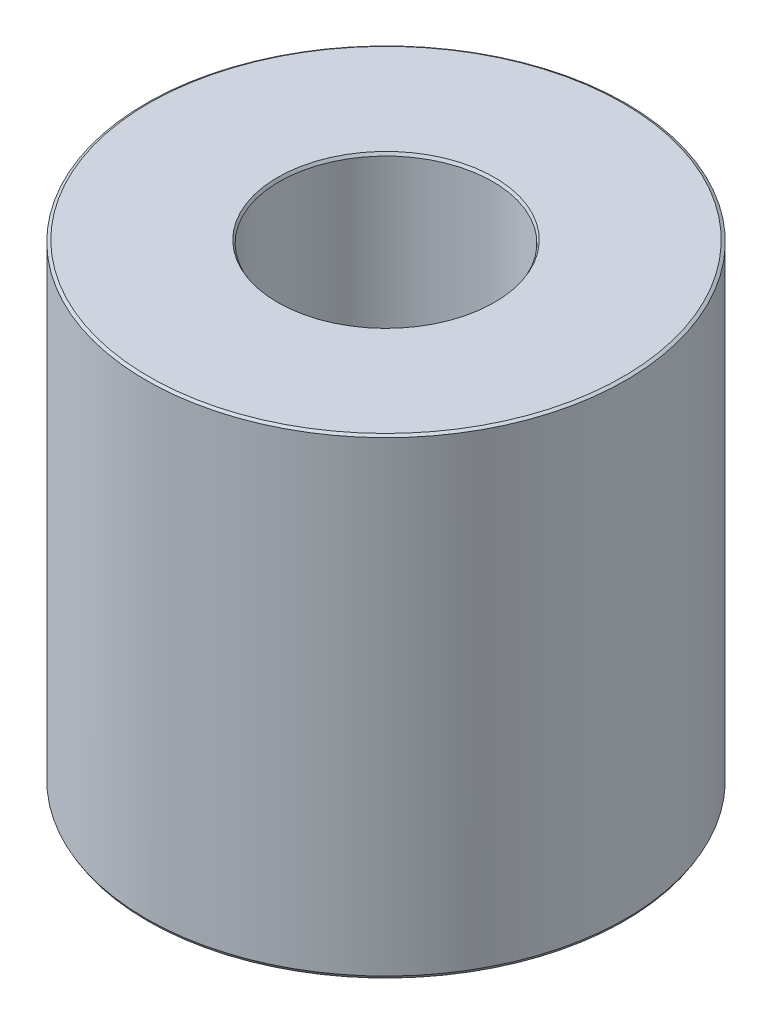
ISO-10303-21;
HEADER;
FILE_DESCRIPTION(('STEP AP214'),'2;1');
FILE_NAME('part.step','',(''),(''),'','','');
FILE_SCHEMA(('AUTOMOTIVE_DESIGN { 1 0 10303 214 1 1 1 1 }'));
ENDSEC;
DATA;
#1=APPLICATION_CONTEXT('core data for automotive mechanical design processes');
#2=APPLICATION_PROTOCOL_DEFINITION('international standard','automotive_design',2000,#1);
#3=PRODUCT_CONTEXT('',#1,'mechanical');
#4=PRODUCT('Part','Part','',(#3));
#5=PRODUCT_RELATED_PRODUCT_CATEGORY('part','',(#4));
#6=PRODUCT_DEFINITION_FORMATION('','',#4);
#7=PRODUCT_DEFINITION_CONTEXT('part definition',#1,'design');
#8=PRODUCT_DEFINITION('design','',#6,#7);
#9=PRODUCT_DEFINITION_SHAPE('','',#8);
#10=(LENGTH_UNIT() NAMED_UNIT(*) SI_UNIT(.MILLI.,.METRE.));
#11=(NAMED_UNIT(*) PLANE_ANGLE_UNIT() SI_UNIT($,.RADIAN.));
#12=(NAMED_UNIT(*) SI_UNIT($,.STERADIAN.) SOLID_ANGLE_UNIT());
#13=UNCERTAINTY_MEASURE_WITH_UNIT(LENGTH_MEASURE(1.E-05),#10,'distance_accuracy_value','');
#14=(GEOMETRIC_REPRESENTATION_CONTEXT(3) GLOBAL_UNCERTAINTY_ASSIGNED_CONTEXT((#13)) GLOBAL_UNIT_ASSIGNED_CONTEXT((#10,
#11,#12)) REPRESENTATION_CONTEXT('',''));
#15=CARTESIAN_POINT('',(0.,0.,0.));
#16=DIRECTION('',(0.,0.,1.));
#17=DIRECTION('',(1.,0.,0.));
#18=AXIS2_PLACEMENT_3D('',#15,#16,#17);
#19=CARTESIAN_POINT('',(0.,78.5003908281606,0.));
#20=DIRECTION('',(0.,-1.,0.));
#21=DIRECTION('',(0.,0.,-1.));
#22=AXIS2_PLACEMENT_3D('',#19,#20,#21);
#23=CYLINDRICAL_SURFACE('',#22,40.);
#24=CARTESIAN_POINT('',(0.,0.475728291631561,0.));
#25=DIRECTION('',(0.,1.,0.));
#26=DIRECTION('',(0.,0.,1.));
#27=AXIS2_PLACEMENT_3D('',#24,#25,#26);
#28=CIRCLE('',#27,40.);
#29=CARTESIAN_POINT('',(0.,0.475728291631561,40.));
#30=VERTEX_POINT('',#29);
#31=EDGE_CURVE('E10',#30,#30,#28,.T.);
#32=ORIENTED_EDGE('',*,*,#31,.T.);
#33=EDGE_LOOP('',(#32));
#34=FACE_BOUND('',#33,.T.);
#35=CARTESIAN_POINT('',(0.,78.225728970926,0.));
#36=DIRECTION('',(0.,1.,0.));
#37=DIRECTION('',(0.,0.,1.));
#38=AXIS2_PLACEMENT_3D('',#35,#36,#37);
#39=CIRCLE('',#38,40.);
#40=CARTESIAN_POINT('',(0.,78.225728970926,-40.));
#41=VERTEX_POINT('',#40);
#42=EDGE_CURVE('E50',#41,#41,#39,.F.);
#43=ORIENTED_EDGE('',*,*,#42,.T.);
#44=EDGE_LOOP('',(#43));
#45=FACE_BOUND('',#44,.T.);
#46=ADVANCED_FACE('F39',(#34,#45),#23,.T.);
#47=CARTESIAN_POINT('',(0.,78.5003908281606,0.));
#48=DIRECTION('',(0.,1.,0.));
#49=DIRECTION('',(0.,0.,1.));
#50=AXIS2_PLACEMENT_3D('',#47,#48,#49);
#51=PLANE('',#50);
#52=CARTESIAN_POINT('',(0.,78.5003908281606,0.));
#53=DIRECTION('',(0.,1.,0.));
#54=DIRECTION('',(0.,0.,1.));
#55=AXIS2_PLACEMENT_3D('',#52,#53,#54);
#56=CIRCLE('',#55,18.0730213265673);
#57=CARTESIAN_POINT('',(0.,78.5003908281606,18.0730213265673));
#58=VERTEX_POINT('',#57);
#59=EDGE_CURVE('E58',#58,#58,#56,.F.);
#60=ORIENTED_EDGE('',*,*,#59,.T.);
#61=EDGE_LOOP('',(#60));
#62=FACE_BOUND('',#61,.T.);
#63=CARTESIAN_POINT('',(0.,78.5003908281606,0.));
#64=DIRECTION('',(0.,1.,0.));
#65=DIRECTION('',(0.,0.,1.));
#66=AXIS2_PLACEMENT_3D('',#63,#64,#65);
#67=CIRCLE('',#66,39.5242717083684);
#68=CARTESIAN_POINT('',(0.,78.5003908281606,-39.5242717083684));
#69=VERTEX_POINT('',#68);
#70=EDGE_CURVE('E61',#69,#69,#67,.T.);
#71=ORIENTED_EDGE('',*,*,#70,.T.);
#72=EDGE_LOOP('',(#71));
#73=FACE_BOUND('',#72,.T.);
#74=ADVANCED_FACE('F88',(#62,#73),#51,.T.);
#75=CARTESIAN_POINT('',(0.,0.,0.));
#76=DIRECTION('',(0.,1.,0.));
#77=DIRECTION('',(0.,0.,1.));
#78=AXIS2_PLACEMENT_3D('',#75,#76,#77);
#79=PLANE('',#78);
#80=CARTESIAN_POINT('',(0.,0.,0.));
#81=DIRECTION('',(0.,1.,0.));
#82=DIRECTION('',(0.,0.,1.));
#83=AXIS2_PLACEMENT_3D('',#80,#81,#82);
#84=CIRCLE('',#83,18.2740877609643);
#85=CARTESIAN_POINT('',(0.,0.,18.2740877609643));
#86=VERTEX_POINT('',#85);
#87=EDGE_CURVE('E51',#86,#86,#84,.T.);
#88=ORIENTED_EDGE('',*,*,#87,.T.);
#89=EDGE_LOOP('',(#88));
#90=FACE_BOUND('',#89,.T.);
#91=CARTESIAN_POINT('',(0.,0.,0.));
#92=DIRECTION('',(0.,1.,0.));
#93=DIRECTION('',(0.,0.,1.));
#94=AXIS2_PLACEMENT_3D('',#91,#92,#93);
#95=CIRCLE('',#94,39.7253381427654);
#96=CARTESIAN_POINT('',(0.,0.,39.7253381427654));
#97=VERTEX_POINT('',#96);
#98=EDGE_CURVE('E54',#97,#97,#95,.F.);
#99=ORIENTED_EDGE('',*,*,#98,.T.);
#100=EDGE_LOOP('',(#99));
#101=FACE_BOUND('',#100,.T.);
#102=ADVANCED_FACE('F83',(#90,#101),#79,.F.);
#103=CARTESIAN_POINT('',(0.,78.5003908281606,0.));
#104=DIRECTION('',(0.,-1.,0.));
#105=DIRECTION('',(0.,0.,-1.));
#106=AXIS2_PLACEMENT_3D('',#103,#104,#105);
#107=CYLINDRICAL_SURFACE('',#106,17.7983594693327);
#108=CARTESIAN_POINT('',(0.,78.0246625365291,0.));
#109=DIRECTION('',(0.,1.,0.));
#110=DIRECTION('',(0.,0.,1.));
#111=AXIS2_PLACEMENT_3D('',#108,#109,#110);
#112=CIRCLE('',#111,17.7983594693327);
#113=CARTESIAN_POINT('',(0.,78.0246625365291,17.7983594693327));
#114=VERTEX_POINT('',#113);
#115=EDGE_CURVE('E67',#114,#114,#112,.T.);
#116=ORIENTED_EDGE('',*,*,#115,.T.);
#117=EDGE_LOOP('',(#116));
#118=FACE_BOUND('',#117,.T.);
#119=CARTESIAN_POINT('',(0.,0.274661857234584,0.));
#120=DIRECTION('',(0.,1.,0.));
#121=DIRECTION('',(0.,0.,1.));
#122=AXIS2_PLACEMENT_3D('',#119,#120,#121);
#123=CIRCLE('',#122,17.7983594693327);
#124=CARTESIAN_POINT('',(0.,0.274661857234584,17.7983594693327));
#125=VERTEX_POINT('',#124);
#126=EDGE_CURVE('E69',#125,#125,#123,.F.);
#127=ORIENTED_EDGE('',*,*,#126,.T.);
#128=EDGE_LOOP('',(#127));
#129=FACE_BOUND('',#128,.T.);
#130=ADVANCED_FACE('F71',(#118,#129),#107,.F.);
#131=CARTESIAN_POINT('',(0.,78.0246625365291,0.));
#132=DIRECTION('',(0.,1.,0.));
#133=DIRECTION('',(0.,0.,1.));
#134=AXIS2_PLACEMENT_3D('',#131,#132,#133);
#135=CONICAL_SURFACE('',#134,17.7983594693327,0.523598775598281);
#136=ORIENTED_EDGE('',*,*,#59,.F.);
#137=EDGE_LOOP('',(#136));
#138=FACE_BOUND('',#137,.T.);
#139=ORIENTED_EDGE('',*,*,#115,.F.);
#140=EDGE_LOOP('',(#139));
#141=FACE_BOUND('',#140,.T.);
#142=ADVANCED_FACE('F77',(#138,#141),#135,.F.);
#143=CARTESIAN_POINT('',(0.,0.,0.));
#144=DIRECTION('',(0.,-1.,0.));
#145=DIRECTION('',(0.,0.,-1.));
#146=AXIS2_PLACEMENT_3D('',#143,#144,#145);
#147=CONICAL_SURFACE('',#146,18.2740877609643,1.0471975511966);
#148=ORIENTED_EDGE('',*,*,#126,.F.);
#149=EDGE_LOOP('',(#148));
#150=FACE_BOUND('',#149,.T.);
#151=ORIENTED_EDGE('',*,*,#87,.F.);
#152=EDGE_LOOP('',(#151));
#153=FACE_BOUND('',#152,.T.);
#154=ADVANCED_FACE('F73',(#150,#153),#147,.F.);
#155=CARTESIAN_POINT('',(0.,0.475728291631561,0.));
#156=DIRECTION('',(0.,1.,0.));
#157=DIRECTION('',(0.,0.,1.));
#158=AXIS2_PLACEMENT_3D('',#155,#156,#157);
#159=CONICAL_SURFACE('',#158,40.,0.523598775598303);
#160=ORIENTED_EDGE('',*,*,#98,.F.);
#161=EDGE_LOOP('',(#160));
#162=FACE_BOUND('',#161,.T.);
#163=ORIENTED_EDGE('',*,*,#31,.F.);
#164=EDGE_LOOP('',(#163));
#165=FACE_BOUND('',#164,.T.);
#166=ADVANCED_FACE('F76',(#162,#165),#159,.T.);
#167=CARTESIAN_POINT('',(0.,78.5003908281606,0.));
#168=DIRECTION('',(0.,-1.,0.));
#169=DIRECTION('',(0.,0.,-1.));
#170=AXIS2_PLACEMENT_3D('',#167,#168,#169);
#171=CONICAL_SURFACE('',#170,39.5242717083684,1.04719755119659);
#172=CARTESIAN_POINT('',(0.,78.225728970926,-40.));
#173=CARTESIAN_POINT('',(0.,78.2285900319389,-39.9950444969622));
#174=CARTESIAN_POINT('',(0.,78.2314510929517,-39.9900889939244));
#175=CARTESIAN_POINT('',(0.,78.2371732149774,-39.9801779878487));
#176=CARTESIAN_POINT('',(0.,78.2400342759903,-39.9752224848109));
#177=CARTESIAN_POINT('',(0.,78.245756398016,-39.9653114787352));
#178=CARTESIAN_POINT('',(0.,78.2486174590289,-39.9603559756974));
#179=CARTESIAN_POINT('',(0.,78.2543395810546,-39.9504449696217));
#180=CARTESIAN_POINT('',(0.,78.2572006420675,-39.9454894665839));
#181=CARTESIAN_POINT('',(0.,78.2629227640932,-39.9355784605082));
#182=CARTESIAN_POINT('',(0.,78.265783825106,-39.9306229574704));
#183=CARTESIAN_POINT('',(0.,78.2715059471318,-39.9207119513948));
#184=CARTESIAN_POINT('',(0.,78.2743670081446,-39.9157564483569));
#185=CARTESIAN_POINT('',(0.,78.2800891301704,-39.9058454422813));
#186=CARTESIAN_POINT('',(0.,78.2829501911832,-39.9008899392434));
#187=CARTESIAN_POINT('',(0.,78.2886723132089,-39.8909789331678));
#188=CARTESIAN_POINT('',(0.,78.2915333742218,-39.88602343013));
#189=CARTESIAN_POINT('',(0.,78.2972554962475,-39.8761124240543));
#190=CARTESIAN_POINT('',(0.,78.3001165572604,-39.8711569210165));
#191=CARTESIAN_POINT('',(0.,78.3058386792861,-39.8612459149408));
#192=CARTESIAN_POINT('',(0.,78.308699740299,-39.856290411903));
#193=CARTESIAN_POINT('',(0.,78.3144218623247,-39.8463794058273));
#194=CARTESIAN_POINT('',(0.,78.3172829233375,-39.8414239027895));
#195=CARTESIAN_POINT('',(0.,78.3230050453633,-39.8315128967138));
#196=CARTESIAN_POINT('',(0.,78.3258661063761,-39.826557393676));
#197=CARTESIAN_POINT('',(0.,78.3315882284018,-39.8166463876003));
#198=CARTESIAN_POINT('',(0.,78.3344492894147,-39.8116908845625));
#199=CARTESIAN_POINT('',(0.,78.3401714114404,-39.8017798784869));
#200=CARTESIAN_POINT('',(0.,78.3430324724533,-39.796824375449));
#201=CARTESIAN_POINT('',(0.,78.348754594479,-39.7869133693734));
#202=CARTESIAN_POINT('',(0.,78.3516156554919,-39.7819578663355));
#203=CARTESIAN_POINT('',(0.,78.3573377775176,-39.7720468602599));
#204=CARTESIAN_POINT('',(0.,78.3601988385305,-39.7670913572221));
#205=CARTESIAN_POINT('',(0.,78.3659209605562,-39.7571803511464));
#206=CARTESIAN_POINT('',(0.,78.368782021569,-39.7522248481086));
#207=CARTESIAN_POINT('',(0.,78.3745041435947,-39.7423138420329));
#208=CARTESIAN_POINT('',(0.,78.3773652046076,-39.7373583389951));
#209=CARTESIAN_POINT('',(0.,78.3830873266333,-39.7274473329194));
#210=CARTESIAN_POINT('',(0.,78.3859483876462,-39.7224918298816));
#211=CARTESIAN_POINT('',(0.,78.3916705096719,-39.7125808238059));
#212=CARTESIAN_POINT('',(0.,78.3945315706847,-39.7076253207681));
#213=CARTESIAN_POINT('',(0.,78.4002536927105,-39.6977143146925));
#214=CARTESIAN_POINT('',(0.,78.4031147537233,-39.6927588116546));
#215=CARTESIAN_POINT('',(0.,78.4088368757491,-39.682847805579));
#216=CARTESIAN_POINT('',(0.,78.4116979367619,-39.6778923025411));
#217=CARTESIAN_POINT('',(0.,78.4174200587876,-39.6679812964655));
#218=CARTESIAN_POINT('',(0.,78.4202811198005,-39.6630257934277));
#219=CARTESIAN_POINT('',(0.,78.4260032418262,-39.653114787352));
#220=CARTESIAN_POINT('',(0.,78.4288643028391,-39.6481592843142));
#221=CARTESIAN_POINT('',(0.,78.4345864248648,-39.6382482782385));
#222=CARTESIAN_POINT('',(0.,78.4374474858777,-39.6332927752007));
#223=CARTESIAN_POINT('',(0.,78.4431696079034,-39.623381769125));
#224=CARTESIAN_POINT('',(0.,78.4460306689163,-39.6184262660872));
#225=CARTESIAN_POINT('',(0.,78.451752790942,-39.6085152600115));
#226=CARTESIAN_POINT('',(0.,78.4546138519548,-39.6035597569737));
#227=CARTESIAN_POINT('',(0.,78.4603359739805,-39.593648750898));
#228=CARTESIAN_POINT('',(0.,78.4631970349934,-39.5886932478602));
#229=CARTESIAN_POINT('',(0.,78.4689191570191,-39.5787822417846));
#230=CARTESIAN_POINT('',(0.,78.471780218032,-39.5738267387467));
#231=CARTESIAN_POINT('',(0.,78.4775023400577,-39.5639157326711));
#232=CARTESIAN_POINT('',(0.,78.4803634010706,-39.5589602296333));
#233=CARTESIAN_POINT('',(0.,78.4860855230963,-39.5490492235576));
#234=CARTESIAN_POINT('',(0.,78.4889465841092,-39.5440937205198));
#235=CARTESIAN_POINT('',(0.,78.4946687061349,-39.5341827144441));
#236=CARTESIAN_POINT('',(0.,78.4975297671477,-39.5292272114063));
#237=CARTESIAN_POINT('',(0.,78.5003908281606,-39.5242717083684));
#238=B_SPLINE_CURVE_WITH_KNOTS('',3,(#172,#173,#174,#175,#176,#177,#178,#179,#180,#181,#182,
#183,#184,#185,#186,#187,#188,#189,#190,#191,#192,#193,#194,#195,#196,#197,#198,#199,#200,#201,
#202,#203,#204,#205,#206,#207,#208,#209,#210,#211,#212,#213,#214,#215,#216,#217,#218,#219,#220,
#221,#222,#223,#224,#225,#226,#227,#228,#229,#230,#231,#232,#233,#234,#235,#236,#237),
.UNSPECIFIED.,.F.,.F.,(4,2,2,2,2,2,2,2,2,2,2,2,2,2,2,2,2,2,2,2,2,2,2,2,2,2,2,2,2,2,2,2,4),(0.,
0.0171663660771704,0.0343327321543278,0.0514990982314981,0.0686654643086556,0.085831830385819,
0.102998196462983,0.120164562540147,0.137330928617304,0.154497294694475,0.171663660771638,
0.188830026848795,0.205996392925966,0.223162759003123,0.240329125080287,0.257495491157451,
0.274661857234614,0.291828223311772,0.308994589388942,0.326160955466099,0.343327321543263,
0.360493687620427,0.377660053697591,0.394826419774748,0.411992785851918,0.429159151929082,
0.446325518006239,0.46349188408341,0.480658250160567,0.49782461623773,0.514990982314895,
0.532157348392058,0.549323714469223),.UNSPECIFIED.);
#239=EDGE_CURVE('BSEAM45',#41,#69,#238,.T.);
#240=ORIENTED_EDGE('',*,*,#42,.F.);
#241=ORIENTED_EDGE('',*,*,#70,.F.);
#242=ORIENTED_EDGE('',*,*,#239,.T.);
#243=ORIENTED_EDGE('',*,*,#239,.F.);
#244=EDGE_LOOP('',(#240,#242,#241,#243));
#245=FACE_BOUND('',#244,.T.);
#246=ADVANCED_FACE('F45',(#245),#171,.T.);
#247=CLOSED_SHELL('',(#46,#74,#102,#130,#142,#154,#166,#246));
#248=MANIFOLD_SOLID_BREP('B2',#247);
#249=ADVANCED_BREP_SHAPE_REPRESENTATION('',(#18,#248),#14);
#250=SHAPE_DEFINITION_REPRESENTATION(#9,#249);
ENDSEC;
END-ISO-10303-21;
